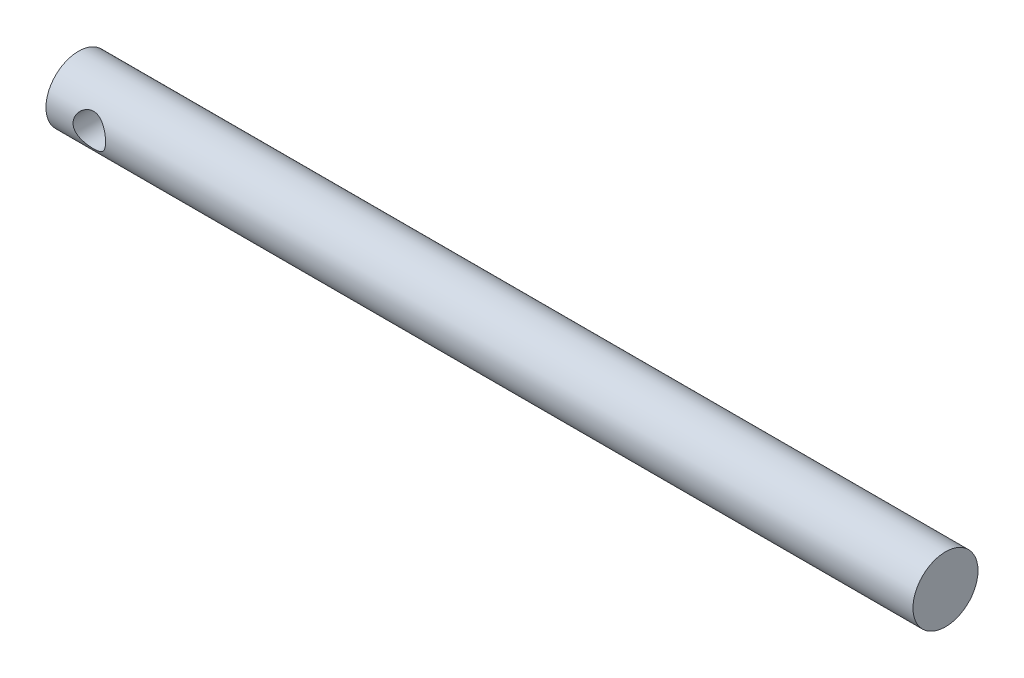
ISO-10303-21;
HEADER;
FILE_DESCRIPTION(('STEP AP214'),'2;1');
FILE_NAME('part.step','',(''),(''),'','','');
FILE_SCHEMA(('AUTOMOTIVE_DESIGN { 1 0 10303 214 1 1 1 1 }'));
ENDSEC;
DATA;
#1=APPLICATION_CONTEXT('core data for automotive mechanical design processes');
#2=APPLICATION_PROTOCOL_DEFINITION('international standard','automotive_design',2000,#1);
#3=PRODUCT_CONTEXT('',#1,'mechanical');
#4=PRODUCT('Part','Part','',(#3));
#5=PRODUCT_RELATED_PRODUCT_CATEGORY('part','',(#4));
#6=PRODUCT_DEFINITION_FORMATION('','',#4);
#7=PRODUCT_DEFINITION_CONTEXT('part definition',#1,'design');
#8=PRODUCT_DEFINITION('design','',#6,#7);
#9=PRODUCT_DEFINITION_SHAPE('','',#8);
#10=(LENGTH_UNIT() NAMED_UNIT(*) SI_UNIT(.MILLI.,.METRE.));
#11=(NAMED_UNIT(*) PLANE_ANGLE_UNIT() SI_UNIT($,.RADIAN.));
#12=(NAMED_UNIT(*) SI_UNIT($,.STERADIAN.) SOLID_ANGLE_UNIT());
#13=UNCERTAINTY_MEASURE_WITH_UNIT(LENGTH_MEASURE(1.E-05),#10,'distance_accuracy_value','');
#14=(GEOMETRIC_REPRESENTATION_CONTEXT(3) GLOBAL_UNCERTAINTY_ASSIGNED_CONTEXT((#13)) GLOBAL_UNIT_ASSIGNED_CONTEXT((#10,
#11,#12)) REPRESENTATION_CONTEXT('',''));
#15=CARTESIAN_POINT('',(0.,0.,0.));
#16=DIRECTION('',(0.,0.,1.));
#17=DIRECTION('',(1.,0.,0.));
#18=AXIS2_PLACEMENT_3D('',#15,#16,#17);
#19=CARTESIAN_POINT('',(40.,0.,0.));
#20=DIRECTION('',(-1.,0.,0.));
#21=DIRECTION('',(0.,0.,1.));
#22=AXIS2_PLACEMENT_3D('',#19,#20,#21);
#23=CYLINDRICAL_SURFACE('',#22,3.);
#24=CARTESIAN_POINT('',(-34.5,0.,-3.));
#25=CARTESIAN_POINT('',(-34.5000049534758,0.0788579444268505,-2.99999570107562));
#26=CARTESIAN_POINT('',(-34.5062551096816,0.157809899546344,-2.99685736529635));
#27=CARTESIAN_POINT('',(-34.5309793205123,0.313380352903345,-2.98461234055736));
#28=CARTESIAN_POINT('',(-34.5494765894967,0.389994130070445,-2.97549431743379));
#29=CARTESIAN_POINT('',(-34.5977907129249,0.538400317320674,-2.95224419105063));
#30=CARTESIAN_POINT('',(-34.6275635763719,0.610210204408719,-2.93813158766306));
#31=CARTESIAN_POINT('',(-34.6973559320475,0.747708925209898,-2.90618664773642));
#32=CARTESIAN_POINT('',(-34.7373746163733,0.81339824098509,-2.88835460450288));
#33=CARTESIAN_POINT('',(-34.8292758742279,0.941261726642864,-2.84934387387093));
#34=CARTESIAN_POINT('',(-34.8817297188595,1.00298281668316,-2.82802798691306));
#35=CARTESIAN_POINT('',(-34.9957822188706,1.11716916730047,-2.78489955370115));
#36=CARTESIAN_POINT('',(-35.0573877776587,1.16962737466015,-2.76308664313552));
#37=CARTESIAN_POINT('',(-35.1937250242851,1.26787800067542,-2.71948426796021));
#38=CARTESIAN_POINT('',(-35.2691041475189,1.31283800332746,-2.69782780455198));
#39=CARTESIAN_POINT('',(-35.4275510039793,1.38925234033605,-2.6592896815848));
#40=CARTESIAN_POINT('',(-35.5106131930841,1.42071632244951,-2.64240461410484));
#41=CARTESIAN_POINT('',(-35.6769976581329,1.46719866328289,-2.61686800556713));
#42=CARTESIAN_POINT('',(-35.7600066781011,1.48308878562067,-2.6077840737557));
#43=CARTESIAN_POINT('',(-35.9279682566692,1.50064048996327,-2.59772834922791));
#44=CARTESIAN_POINT('',(-36.0129188113067,1.50231613255961,-2.59674854014932));
#45=CARTESIAN_POINT('',(-36.1714290364731,1.49203093075845,-2.60266395385873));
#46=CARTESIAN_POINT('',(-36.2451360468346,1.48167683930524,-2.6086314549302));
#47=CARTESIAN_POINT('',(-36.3895828640596,1.4504097735854,-2.62614343100775));
#48=CARTESIAN_POINT('',(-36.460321717958,1.42949343584648,-2.63768968247664));
#49=CARTESIAN_POINT('',(-36.5988436988485,1.37731467057901,-2.66531214619111));
#50=CARTESIAN_POINT('',(-36.6665195981787,1.345822600674,-2.68148760995998));
#51=CARTESIAN_POINT('',(-36.795951438885,1.27356253150201,-2.71655106422105));
#52=CARTESIAN_POINT('',(-36.8577047034001,1.23279036571871,-2.73544027170286));
#53=CARTESIAN_POINT('',(-36.9817818791148,1.13709908236919,-2.77669736854928));
#54=CARTESIAN_POINT('',(-37.0431853103642,1.08104168755393,-2.79920265355119));
#55=CARTESIAN_POINT('',(-37.1561031278864,0.959333368112066,-2.84321434950611));
#56=CARTESIAN_POINT('',(-37.2076127880508,0.893677884861434,-2.86472027938201));
#57=CARTESIAN_POINT('',(-37.3015284915446,0.750774758747778,-2.90552980924446));
#58=CARTESIAN_POINT('',(-37.3434007086686,0.673130387399117,-2.92468476243011));
#59=CARTESIAN_POINT('',(-37.4131455435645,0.510699323233196,-2.95736821681863));
#60=CARTESIAN_POINT('',(-37.4410292775228,0.425918364397915,-2.9709011841533));
#61=CARTESIAN_POINT('',(-37.479713105575,0.259149737491054,-2.98986500612153));
#62=CARTESIAN_POINT('',(-37.4917368536202,0.17751229582249,-2.99587407451965));
#63=CARTESIAN_POINT('',(-37.5021970967017,0.0131693999240292,-3.00109520188655));
#64=CARTESIAN_POINT('',(-37.5006400284592,-0.0695355298048607,-3.00031048081978));
#65=CARTESIAN_POINT('',(-37.4846899673719,-0.226849457978979,-2.99236788380152));
#66=CARTESIAN_POINT('',(-37.471301200905,-0.301589112074895,-2.98570868532252));
#67=CARTESIAN_POINT('',(-37.4336428921573,-0.447610338452912,-2.9673325697226));
#68=CARTESIAN_POINT('',(-37.4093721503198,-0.51889152853663,-2.95561509501618));
#69=CARTESIAN_POINT('',(-37.3500023003505,-0.658332912674359,-2.92776377120382));
#70=CARTESIAN_POINT('',(-37.3146134248256,-0.726345595508705,-2.91151322654446));
#71=CARTESIAN_POINT('',(-37.2343386965302,-0.855692042548908,-2.87615961476126));
#72=CARTESIAN_POINT('',(-37.1894487981069,-0.917022944664888,-2.85705533350407));
#73=CARTESIAN_POINT('',(-37.0863593620039,-1.03765153393382,-2.81562332004297));
#74=CARTESIAN_POINT('',(-37.0272856973323,-1.09615811672854,-2.79316327265249));
#75=CARTESIAN_POINT('',(-36.9001122730834,-1.20278448167829,-2.7489358741323));
#76=CARTESIAN_POINT('',(-36.8320063217281,-1.25089707856781,-2.72716901100071));
#77=CARTESIAN_POINT('',(-36.6845345187405,-1.33756187171853,-2.68576788309734));
#78=CARTESIAN_POINT('',(-36.6047831008583,-1.37553824370037,-2.66628794383591));
#79=CARTESIAN_POINT('',(-36.4387348986376,-1.43712423890206,-2.63361108441202));
#80=CARTESIAN_POINT('',(-36.3524467102997,-1.46075237380053,-2.62040607332625));
#81=CARTESIAN_POINT('',(-36.184634665673,-1.49079253120031,-2.60342251538703));
#82=CARTESIAN_POINT('',(-36.1034486198471,-1.49863949460818,-2.59886075197597));
#83=CARTESIAN_POINT('',(-35.9408293992532,-1.50103373156431,-2.59748031962405));
#84=CARTESIAN_POINT('',(-35.8593963468932,-1.49558676993487,-2.60065829439585));
#85=CARTESIAN_POINT('',(-35.7067747476999,-1.47288918838997,-2.61356793076615));
#86=CARTESIAN_POINT('',(-35.6353492947829,-1.45681247151455,-2.62264641723987));
#87=CARTESIAN_POINT('',(-35.4962878208635,-1.41476303733662,-2.64556524281479));
#88=CARTESIAN_POINT('',(-35.428653026862,-1.38878713673989,-2.65940711354503));
#89=CARTESIAN_POINT('',(-35.2940627235202,-1.32572361795085,-2.69142795546803));
#90=CARTESIAN_POINT('',(-35.2274581472565,-1.28800670672355,-2.70983583593881));
#91=CARTESIAN_POINT('',(-35.1010881957281,-1.20322645745609,-2.7485299745229));
#92=CARTESIAN_POINT('',(-35.0413264042183,-1.15615825686235,-2.76881720693416));
#93=CARTESIAN_POINT('',(-34.922787026468,-1.04730498999207,-2.81193484737138));
#94=CARTESIAN_POINT('',(-34.8650113464746,-0.984426634495899,-2.83477474959942));
#95=CARTESIAN_POINT('',(-34.7606055248471,-0.849232209349803,-2.87816628389896));
#96=CARTESIAN_POINT('',(-34.7139813907951,-0.776911084957804,-2.89871667939292));
#97=CARTESIAN_POINT('',(-34.6331454559319,-0.623897395174428,-2.93547014349806));
#98=CARTESIAN_POINT('',(-34.5990237461453,-0.543149255665105,-2.95164144740899));
#99=CARTESIAN_POINT('',(-34.5452877483639,-0.376113151707137,-2.9775201194848));
#100=CARTESIAN_POINT('',(-34.5256322297914,-0.289841699383655,-2.98724585044602));
#101=CARTESIAN_POINT('',(-34.5091538833714,-0.168902919736347,-2.99543192870217));
#102=CARTESIAN_POINT('',(-34.5057260387005,-0.135242819162351,-2.99714048010376));
#103=CARTESIAN_POINT('',(-34.5011480017289,-0.0677275977076394,-2.99942545465223));
#104=CARTESIAN_POINT('',(-34.4999978722947,-0.0338724714699437,-3.00000184655071));
#105=CARTESIAN_POINT('',(-34.5,0.,-3.));
#106=B_SPLINE_CURVE_WITH_KNOTS('',3,(#24,#25,#26,#27,#28,#29,#30,#31,#32,#33,#34,#35,#36,#37,
#38,#39,#40,#41,#42,#43,#44,#45,#46,#47,#48,#49,#50,#51,#52,#53,#54,#55,#56,#57,#58,#59,#60,#61,
#62,#63,#64,#65,#66,#67,#68,#69,#70,#71,#72,#73,#74,#75,#76,#77,#78,#79,#80,#81,#82,#83,#84,#85,
#86,#87,#88,#89,#90,#91,#92,#93,#94,#95,#96,#97,#98,#99,#100,#101,#102,#103,#104,#105),
.UNSPECIFIED.,.T.,.F.,(4,2,2,2,2,2,2,2,2,2,2,2,2,2,2,2,2,2,2,2,2,2,2,2,2,2,2,2,2,2,2,2,2,2,2,2,
2,2,2,2,4),(0.,0.236436386130439,0.473322224563797,0.709293233238445,0.945245640872351,
1.19547263807713,1.44588935648105,1.7157258964613,1.98536921847422,2.23887018210345,
2.49212035993531,2.71508568613981,2.93812205888518,3.16635360252731,3.39468781890333,
3.65197412000819,3.9093830189803,4.17874533321662,4.44789325368421,4.6947493570702,
4.94148846767215,5.16910359759184,5.39674382446398,5.63089284041849,5.86514176122511,
6.1223941596663,6.37982382923149,6.6497202324259,6.91926767918177,7.16293961254571,
7.40650589797019,7.62686895373286,7.84730293182529,8.08254685170433,8.31791341715448,
8.58187864135759,8.8459857507187,9.11196020495292,9.37717362931726,9.47872920200878,
9.58028757766602),.UNSPECIFIED.);
#107=CARTESIAN_POINT('',(-34.5,0.,-3.));
#108=VERTEX_POINT('',#107);
#109=EDGE_CURVE('E10',#108,#108,#106,.T.);
#110=ORIENTED_EDGE('',*,*,#109,.T.);
#111=EDGE_LOOP('',(#110));
#112=FACE_BOUND('',#111,.T.);
#113=CARTESIAN_POINT('',(-34.5,0.,3.));
#114=CARTESIAN_POINT('',(-34.5000049534758,-0.0788579444268505,2.99999570107562));
#115=CARTESIAN_POINT('',(-34.5062551096816,-0.157809899546344,2.99685736529635));
#116=CARTESIAN_POINT('',(-34.5309793205123,-0.313380352903345,2.98461234055736));
#117=CARTESIAN_POINT('',(-34.5494765894967,-0.389994130070445,2.97549431743379));
#118=CARTESIAN_POINT('',(-34.5977907129249,-0.538400317320673,2.95224419105063));
#119=CARTESIAN_POINT('',(-34.6275635763719,-0.610210204408717,2.93813158766306));
#120=CARTESIAN_POINT('',(-34.6973559320475,-0.747708925209896,2.90618664773642));
#121=CARTESIAN_POINT('',(-34.7373746163733,-0.813398240985089,2.88835460450288));
#122=CARTESIAN_POINT('',(-34.8292758742279,-0.941261726642865,2.84934387387093));
#123=CARTESIAN_POINT('',(-34.8817297188595,-1.00298281668316,2.82802798691306));
#124=CARTESIAN_POINT('',(-34.9957822188706,-1.11716916730047,2.78489955370115));
#125=CARTESIAN_POINT('',(-35.0573877776587,-1.16962737466015,2.76308664313552));
#126=CARTESIAN_POINT('',(-35.1937250242851,-1.26787800067542,2.71948426796021));
#127=CARTESIAN_POINT('',(-35.2691041475189,-1.31283800332746,2.69782780455198));
#128=CARTESIAN_POINT('',(-35.4275510039793,-1.38925234033605,2.65928968158481));
#129=CARTESIAN_POINT('',(-35.5106131930841,-1.4207163224495,2.64240461410484));
#130=CARTESIAN_POINT('',(-35.6769976581329,-1.46719866328289,2.61686800556713));
#131=CARTESIAN_POINT('',(-35.7600066781011,-1.48308878562067,2.6077840737557));
#132=CARTESIAN_POINT('',(-35.9279682566692,-1.50064048996327,2.59772834922791));
#133=CARTESIAN_POINT('',(-36.0129188113067,-1.50231613255961,2.59674854014932));
#134=CARTESIAN_POINT('',(-36.1714290364731,-1.49203093075845,2.60266395385873));
#135=CARTESIAN_POINT('',(-36.2451360468346,-1.48167683930524,2.6086314549302));
#136=CARTESIAN_POINT('',(-36.3895828640596,-1.4504097735854,2.62614343100775));
#137=CARTESIAN_POINT('',(-36.460321717958,-1.42949343584648,2.63768968247664));
#138=CARTESIAN_POINT('',(-36.5988436988485,-1.37731467057901,2.66531214619111));
#139=CARTESIAN_POINT('',(-36.6665195981787,-1.345822600674,2.68148760995998));
#140=CARTESIAN_POINT('',(-36.795951438885,-1.27356253150201,2.71655106422105));
#141=CARTESIAN_POINT('',(-36.8577047034001,-1.23279036571871,2.73544027170286));
#142=CARTESIAN_POINT('',(-36.9817818791148,-1.13709908236919,2.77669736854928));
#143=CARTESIAN_POINT('',(-37.0431853103642,-1.08104168755393,2.79920265355119));
#144=CARTESIAN_POINT('',(-37.1561031278864,-0.959333368112066,2.84321434950611));
#145=CARTESIAN_POINT('',(-37.2076127880508,-0.893677884861434,2.86472027938201));
#146=CARTESIAN_POINT('',(-37.3015284915446,-0.750774758747778,2.90552980924446));
#147=CARTESIAN_POINT('',(-37.3434007086686,-0.673130387399117,2.92468476243011));
#148=CARTESIAN_POINT('',(-37.4131455435645,-0.510699323233197,2.95736821681863));
#149=CARTESIAN_POINT('',(-37.4410292775228,-0.425918364397915,2.9709011841533));
#150=CARTESIAN_POINT('',(-37.479713105575,-0.259149737491055,2.98986500612153));
#151=CARTESIAN_POINT('',(-37.4917368536202,-0.177512295822491,2.99587407451965));
#152=CARTESIAN_POINT('',(-37.5021970967017,-0.0131693999240304,3.00109520188655));
#153=CARTESIAN_POINT('',(-37.5006400284592,0.0695355298048598,3.00031048081978));
#154=CARTESIAN_POINT('',(-37.4846899673719,0.226849457978978,2.99236788380152));
#155=CARTESIAN_POINT('',(-37.471301200905,0.301589112074893,2.98570868532253));
#156=CARTESIAN_POINT('',(-37.4336428921573,0.447610338452911,2.9673325697226));
#157=CARTESIAN_POINT('',(-37.4093721503198,0.51889152853663,2.95561509501618));
#158=CARTESIAN_POINT('',(-37.3500023003505,0.658332912674359,2.92776377120382));
#159=CARTESIAN_POINT('',(-37.3146134248256,0.726345595508705,2.91151322654446));
#160=CARTESIAN_POINT('',(-37.2343386965302,0.855692042548908,2.87615961476126));
#161=CARTESIAN_POINT('',(-37.1894487981069,0.917022944664889,2.85705533350407));
#162=CARTESIAN_POINT('',(-37.0863593620039,1.03765153393382,2.81562332004297));
#163=CARTESIAN_POINT('',(-37.0272856973323,1.09615811672854,2.79316327265249));
#164=CARTESIAN_POINT('',(-36.9001122730834,1.20278448167828,2.7489358741323));
#165=CARTESIAN_POINT('',(-36.8320063217281,1.25089707856781,2.72716901100071));
#166=CARTESIAN_POINT('',(-36.6845345187405,1.33756187171853,2.68576788309734));
#167=CARTESIAN_POINT('',(-36.6047831008583,1.37553824370037,2.66628794383591));
#168=CARTESIAN_POINT('',(-36.4387348986376,1.43712423890206,2.63361108441202));
#169=CARTESIAN_POINT('',(-36.3524467102997,1.46075237380053,2.62040607332625));
#170=CARTESIAN_POINT('',(-36.184634665673,1.49079253120031,2.60342251538703));
#171=CARTESIAN_POINT('',(-36.1034486198471,1.49863949460818,2.59886075197597));
#172=CARTESIAN_POINT('',(-35.9408293992532,1.50103373156431,2.59748031962405));
#173=CARTESIAN_POINT('',(-35.8593963468932,1.49558676993487,2.60065829439585));
#174=CARTESIAN_POINT('',(-35.7067747476999,1.47288918838997,2.61356793076615));
#175=CARTESIAN_POINT('',(-35.6353492947829,1.45681247151456,2.62264641723987));
#176=CARTESIAN_POINT('',(-35.4962878208635,1.41476303733662,2.64556524281479));
#177=CARTESIAN_POINT('',(-35.428653026862,1.38878713673989,2.65940711354502));
#178=CARTESIAN_POINT('',(-35.2940627235202,1.32572361795085,2.69142795546803));
#179=CARTESIAN_POINT('',(-35.2274581472565,1.28800670672355,2.70983583593881));
#180=CARTESIAN_POINT('',(-35.1010881957281,1.20322645745609,2.7485299745229));
#181=CARTESIAN_POINT('',(-35.0413264042183,1.15615825686235,2.76881720693416));
#182=CARTESIAN_POINT('',(-34.922787026468,1.04730498999207,2.81193484737138));
#183=CARTESIAN_POINT('',(-34.8650113464746,0.984426634495899,2.83477474959942));
#184=CARTESIAN_POINT('',(-34.7606055248471,0.849232209349804,2.87816628389896));
#185=CARTESIAN_POINT('',(-34.7139813907951,0.776911084957804,2.89871667939292));
#186=CARTESIAN_POINT('',(-34.6331454559319,0.623897395174428,2.93547014349806));
#187=CARTESIAN_POINT('',(-34.5990237461453,0.543149255665105,2.95164144740899));
#188=CARTESIAN_POINT('',(-34.5452877483639,0.376113151707138,2.9775201194848));
#189=CARTESIAN_POINT('',(-34.5256322297914,0.289841699383656,2.98724585044602));
#190=CARTESIAN_POINT('',(-34.5091538833714,0.168902919736348,2.99543192870217));
#191=CARTESIAN_POINT('',(-34.5057260387005,0.135242819162352,2.99714048010376));
#192=CARTESIAN_POINT('',(-34.5011480017289,0.0677275977076399,2.99942545465223));
#193=CARTESIAN_POINT('',(-34.4999978722947,0.0338724714699439,3.00000184655071));
#194=CARTESIAN_POINT('',(-34.5,0.,3.));
#195=B_SPLINE_CURVE_WITH_KNOTS('',3,(#113,#114,#115,#116,#117,#118,#119,#120,#121,#122,#123,
#124,#125,#126,#127,#128,#129,#130,#131,#132,#133,#134,#135,#136,#137,#138,#139,#140,#141,#142,
#143,#144,#145,#146,#147,#148,#149,#150,#151,#152,#153,#154,#155,#156,#157,#158,#159,#160,#161,
#162,#163,#164,#165,#166,#167,#168,#169,#170,#171,#172,#173,#174,#175,#176,#177,#178,#179,#180,
#181,#182,#183,#184,#185,#186,#187,#188,#189,#190,#191,#192,#193,#194),.UNSPECIFIED.,.T.,.F.,(4,
2,2,2,2,2,2,2,2,2,2,2,2,2,2,2,2,2,2,2,2,2,2,2,2,2,2,2,2,2,2,2,2,2,2,2,2,2,2,2,4),(0.,
0.236436386130439,0.473322224563797,0.709293233238443,0.945245640872351,1.19547263807713,
1.44588935648105,1.71572589646129,1.98536921847422,2.23887018210345,2.49212035993531,
2.71508568613981,2.93812205888518,3.16635360252731,3.39468781890333,3.65197412000819,
3.9093830189803,4.17874533321662,4.44789325368421,4.6947493570702,4.94148846767215,
5.16910359759184,5.39674382446399,5.63089284041849,5.8651417612251,6.1223941596663,
6.3798238292315,6.6497202324259,6.91926767918177,7.16293961254571,7.40650589797019,
7.62686895373285,7.84730293182529,8.08254685170434,8.31791341715448,8.58187864135759,
8.84598575071871,9.11196020495292,9.37717362931726,9.47872920200878,9.58028757766602),.UNSPECIFIED.);
#196=CARTESIAN_POINT('',(-34.5,0.,3.));
#197=VERTEX_POINT('',#196);
#198=EDGE_CURVE('E42',#197,#197,#195,.T.);
#199=ORIENTED_EDGE('',*,*,#198,.T.);
#200=EDGE_LOOP('',(#199));
#201=FACE_BOUND('',#200,.T.);
#202=CARTESIAN_POINT('',(40.,0.,0.));
#203=DIRECTION('',(1.,0.,0.));
#204=DIRECTION('',(0.,0.,-1.));
#205=AXIS2_PLACEMENT_3D('',#202,#203,#204);
#206=CIRCLE('',#205,3.);
#207=CARTESIAN_POINT('',(40.,0.,-3.));
#208=VERTEX_POINT('',#207);
#209=EDGE_CURVE('E46',#208,#208,#206,.T.);
#210=ORIENTED_EDGE('',*,*,#209,.F.);
#211=EDGE_LOOP('',(#210));
#212=FACE_BOUND('',#211,.T.);
#213=CARTESIAN_POINT('',(-40.,0.,0.));
#214=DIRECTION('',(1.,0.,0.));
#215=DIRECTION('',(0.,0.,-1.));
#216=AXIS2_PLACEMENT_3D('',#213,#214,#215);
#217=CIRCLE('',#216,3.);
#218=CARTESIAN_POINT('',(-40.,0.,-3.));
#219=VERTEX_POINT('',#218);
#220=EDGE_CURVE('E50',#219,#219,#217,.T.);
#221=ORIENTED_EDGE('',*,*,#220,.T.);
#222=EDGE_LOOP('',(#221));
#223=FACE_BOUND('',#222,.T.);
#224=ADVANCED_FACE('F31',(#112,#201,#212,#223),#23,.T.);
#225=CARTESIAN_POINT('',(40.,0.,0.));
#226=DIRECTION('',(1.,0.,0.));
#227=DIRECTION('',(0.,0.,-1.));
#228=AXIS2_PLACEMENT_3D('',#225,#226,#227);
#229=PLANE('',#228);
#230=ORIENTED_EDGE('',*,*,#209,.T.);
#231=EDGE_LOOP('',(#230));
#232=FACE_BOUND('',#231,.T.);
#233=ADVANCED_FACE('F62',(#232),#229,.T.);
#234=CARTESIAN_POINT('',(-40.,0.,0.));
#235=DIRECTION('',(1.,0.,0.));
#236=DIRECTION('',(0.,0.,-1.));
#237=AXIS2_PLACEMENT_3D('',#234,#235,#236);
#238=PLANE('',#237);
#239=ORIENTED_EDGE('',*,*,#220,.F.);
#240=EDGE_LOOP('',(#239));
#241=FACE_BOUND('',#240,.T.);
#242=ADVANCED_FACE('F60',(#241),#238,.F.);
#243=CARTESIAN_POINT('',(-36.,0.,-3.));
#244=DIRECTION('',(0.,0.,1.));
#245=DIRECTION('',(1.,0.,0.));
#246=AXIS2_PLACEMENT_3D('',#243,#244,#245);
#247=CYLINDRICAL_SURFACE('',#246,1.5);
#248=ORIENTED_EDGE('',*,*,#198,.F.);
#249=EDGE_LOOP('',(#248));
#250=FACE_BOUND('',#249,.T.);
#251=ORIENTED_EDGE('',*,*,#109,.F.);
#252=EDGE_LOOP('',(#251));
#253=FACE_BOUND('',#252,.T.);
#254=ADVANCED_FACE('F56',(#250,#253),#247,.F.);
#255=CLOSED_SHELL('',(#224,#233,#242,#254));
#256=MANIFOLD_SOLID_BREP('B2',#255);
#257=ADVANCED_BREP_SHAPE_REPRESENTATION('',(#18,#256),#14);
#258=SHAPE_DEFINITION_REPRESENTATION(#9,#257);
ENDSEC;
END-ISO-10303-21;
